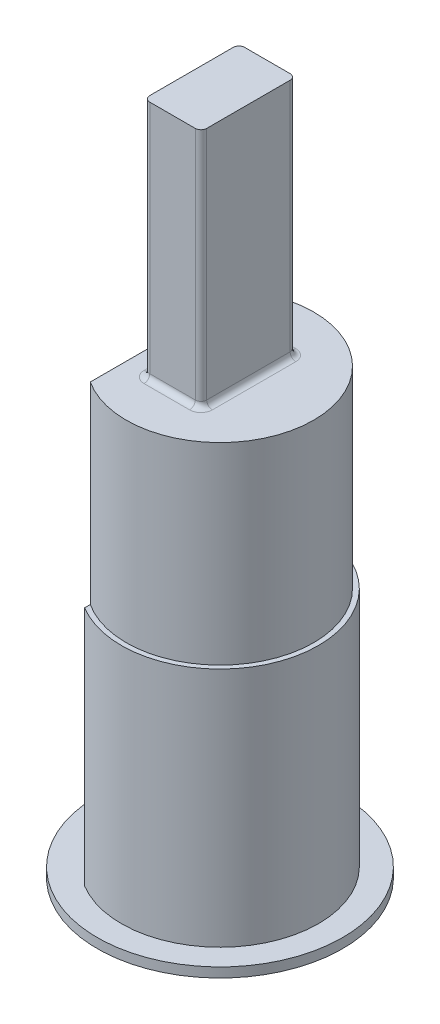
ISO-10303-21;
HEADER;
FILE_DESCRIPTION(('STEP AP214'),'2;1');
FILE_NAME('part.step','',(''),(''),'','','');
FILE_SCHEMA(('AUTOMOTIVE_DESIGN { 1 0 10303 214 1 1 1 1 }'));
ENDSEC;
DATA;
#1=APPLICATION_CONTEXT('core data for automotive mechanical design processes');
#2=APPLICATION_PROTOCOL_DEFINITION('international standard','automotive_design',2000,#1);
#3=PRODUCT_CONTEXT('',#1,'mechanical');
#4=PRODUCT('Part','Part','',(#3));
#5=PRODUCT_RELATED_PRODUCT_CATEGORY('part','',(#4));
#6=PRODUCT_DEFINITION_FORMATION('','',#4);
#7=PRODUCT_DEFINITION_CONTEXT('part definition',#1,'design');
#8=PRODUCT_DEFINITION('design','',#6,#7);
#9=PRODUCT_DEFINITION_SHAPE('','',#8);
#10=(LENGTH_UNIT() NAMED_UNIT(*) SI_UNIT(.MILLI.,.METRE.));
#11=(NAMED_UNIT(*) PLANE_ANGLE_UNIT() SI_UNIT($,.RADIAN.));
#12=(NAMED_UNIT(*) SI_UNIT($,.STERADIAN.) SOLID_ANGLE_UNIT());
#13=UNCERTAINTY_MEASURE_WITH_UNIT(LENGTH_MEASURE(1.E-05),#10,'distance_accuracy_value','');
#14=(GEOMETRIC_REPRESENTATION_CONTEXT(3) GLOBAL_UNCERTAINTY_ASSIGNED_CONTEXT((#13)) GLOBAL_UNIT_ASSIGNED_CONTEXT((#10,
#11,#12)) REPRESENTATION_CONTEXT('',''));
#15=CARTESIAN_POINT('',(0.,0.,0.));
#16=DIRECTION('',(0.,0.,1.));
#17=DIRECTION('',(1.,0.,0.));
#18=AXIS2_PLACEMENT_3D('',#15,#16,#17);
#19=CARTESIAN_POINT('',(0.,22.86,0.));
#20=DIRECTION('',(0.,1.,0.));
#21=DIRECTION('',(0.,0.,1.));
#22=AXIS2_PLACEMENT_3D('',#19,#20,#21);
#23=PLANE('',#22);
#24=DIRECTION('',(0.,0.,-1.));
#25=VECTOR('',#24,1.);
#26=CARTESIAN_POINT('',(1.8,22.86,0.));
#27=LINE('',#26,#25);
#28=CARTESIAN_POINT('',(1.8,22.86,-2.2));
#29=VERTEX_POINT('',#28);
#30=CARTESIAN_POINT('',(1.8,22.86,2.2));
#31=VERTEX_POINT('',#30);
#32=EDGE_CURVE('E222',#29,#31,#27,.F.);
#33=ORIENTED_EDGE('',*,*,#32,.T.);
#34=CARTESIAN_POINT('',(1.2,22.86,2.2));
#35=DIRECTION('',(0.,1.,0.));
#36=DIRECTION('',(0.,0.,1.));
#37=AXIS2_PLACEMENT_3D('',#34,#35,#36);
#38=CIRCLE('',#37,0.6);
#39=CARTESIAN_POINT('',(1.2,22.86,2.8));
#40=VERTEX_POINT('',#39);
#41=EDGE_CURVE('E207',#31,#40,#38,.F.);
#42=ORIENTED_EDGE('',*,*,#41,.T.);
#43=DIRECTION('',(1.,0.,0.));
#44=VECTOR('',#43,1.);
#45=CARTESIAN_POINT('',(0.,22.86,2.8));
#46=LINE('',#45,#44);
#47=CARTESIAN_POINT('',(-1.2,22.86,2.8));
#48=VERTEX_POINT('',#47);
#49=EDGE_CURVE('E210',#40,#48,#46,.F.);
#50=ORIENTED_EDGE('',*,*,#49,.T.);
#51=CARTESIAN_POINT('',(-1.2,22.86,2.2));
#52=DIRECTION('',(0.,1.,0.));
#53=DIRECTION('',(0.,0.,1.));
#54=AXIS2_PLACEMENT_3D('',#51,#52,#53);
#55=CIRCLE('',#54,0.6);
#56=CARTESIAN_POINT('',(-1.8,22.86,2.2));
#57=VERTEX_POINT('',#56);
#58=EDGE_CURVE('E212',#48,#57,#55,.F.);
#59=ORIENTED_EDGE('',*,*,#58,.T.);
#60=DIRECTION('',(0.,0.,1.));
#61=VECTOR('',#60,1.);
#62=CARTESIAN_POINT('',(-1.8,22.86,0.));
#63=LINE('',#62,#61);
#64=CARTESIAN_POINT('',(-1.8,22.86,-2.2));
#65=VERTEX_POINT('',#64);
#66=EDGE_CURVE('E214',#57,#65,#63,.F.);
#67=ORIENTED_EDGE('',*,*,#66,.T.);
#68=CARTESIAN_POINT('',(-1.2,22.86,-2.2));
#69=DIRECTION('',(0.,1.,0.));
#70=DIRECTION('',(0.,0.,1.));
#71=AXIS2_PLACEMENT_3D('',#68,#69,#70);
#72=CIRCLE('',#71,0.6);
#73=CARTESIAN_POINT('',(-1.2,22.86,-2.8));
#74=VERTEX_POINT('',#73);
#75=EDGE_CURVE('E216',#65,#74,#72,.F.);
#76=ORIENTED_EDGE('',*,*,#75,.T.);
#77=DIRECTION('',(-1.,0.,0.));
#78=VECTOR('',#77,1.);
#79=CARTESIAN_POINT('',(0.,22.86,-2.8));
#80=LINE('',#79,#78);
#81=CARTESIAN_POINT('',(1.2,22.86,-2.8));
#82=VERTEX_POINT('',#81);
#83=EDGE_CURVE('E218',#74,#82,#80,.F.);
#84=ORIENTED_EDGE('',*,*,#83,.T.);
#85=CARTESIAN_POINT('',(1.2,22.86,-2.2));
#86=DIRECTION('',(0.,1.,0.));
#87=DIRECTION('',(0.,0.,1.));
#88=AXIS2_PLACEMENT_3D('',#85,#86,#87);
#89=CIRCLE('',#88,0.6);
#90=EDGE_CURVE('E220',#82,#29,#89,.F.);
#91=ORIENTED_EDGE('',*,*,#90,.T.);
#92=EDGE_LOOP('',(#33,#42,#50,#59,#67,#76,#84,#91));
#93=FACE_BOUND('',#92,.T.);
#94=DIRECTION('',(0.,0.,1.));
#95=VECTOR('',#94,1.);
#96=CARTESIAN_POINT('',(-2.68996703044852,22.86,-4.445));
#97=LINE('',#96,#95);
#98=CARTESIAN_POINT('',(-2.68996703044852,22.86,-4.14526132348734));
#99=VERTEX_POINT('',#98);
#100=CARTESIAN_POINT('',(-2.68996703044852,22.86,4.14526132348734));
#101=VERTEX_POINT('',#100);
#102=EDGE_CURVE('E167',#99,#101,#97,.T.);
#103=ORIENTED_EDGE('',*,*,#102,.T.);
#104=CARTESIAN_POINT('',(0.,22.86,0.));
#105=DIRECTION('',(0.,1.,0.));
#106=DIRECTION('',(0.,0.,1.));
#107=AXIS2_PLACEMENT_3D('',#104,#105,#106);
#108=CIRCLE('',#107,4.94157);
#109=EDGE_CURVE('E53',#101,#99,#108,.T.);
#110=ORIENTED_EDGE('',*,*,#109,.T.);
#111=EDGE_LOOP('',(#103,#110));
#112=FACE_BOUND('',#111,.T.);
#113=ADVANCED_FACE('F37',(#93,#112),#23,.T.);
#114=CARTESIAN_POINT('',(0.,22.86,0.));
#115=DIRECTION('',(0.,-1.,0.));
#116=DIRECTION('',(0.,0.,-1.));
#117=AXIS2_PLACEMENT_3D('',#114,#115,#116);
#118=CYLINDRICAL_SURFACE('',#117,5.19557);
#119=CARTESIAN_POINT('',(0.,12.7,0.));
#120=DIRECTION('',(0.,1.,0.));
#121=DIRECTION('',(0.,0.,1.));
#122=AXIS2_PLACEMENT_3D('',#119,#120,#121);
#123=CIRCLE('',#122,5.19557);
#124=CARTESIAN_POINT('',(-2.68996703044852,12.7,4.445));
#125=VERTEX_POINT('',#124);
#126=CARTESIAN_POINT('',(-2.68996703044852,12.7,-4.445));
#127=VERTEX_POINT('',#126);
#128=EDGE_CURVE('E157',#125,#127,#123,.T.);
#129=ORIENTED_EDGE('',*,*,#128,.F.);
#130=DIRECTION('',(0.,-1.,0.));
#131=VECTOR('',#130,1.);
#132=CARTESIAN_POINT('',(-2.68996703044852,22.86,4.445));
#133=LINE('',#132,#131);
#134=CARTESIAN_POINT('',(-2.68996703044852,0.,4.445));
#135=VERTEX_POINT('',#134);
#136=EDGE_CURVE('E229',#125,#135,#133,.T.);
#137=ORIENTED_EDGE('',*,*,#136,.T.);
#138=CARTESIAN_POINT('',(0.,0.,0.));
#139=DIRECTION('',(0.,1.,0.));
#140=DIRECTION('',(0.,0.,1.));
#141=AXIS2_PLACEMENT_3D('',#138,#139,#140);
#142=CIRCLE('',#141,5.19557);
#143=CARTESIAN_POINT('',(-2.68996703044852,0.,-4.445));
#144=VERTEX_POINT('',#143);
#145=EDGE_CURVE('E234',#135,#144,#142,.T.);
#146=ORIENTED_EDGE('',*,*,#145,.T.);
#147=DIRECTION('',(0.,-1.,0.));
#148=VECTOR('',#147,1.);
#149=CARTESIAN_POINT('',(-2.68996703044852,22.86,-4.445));
#150=LINE('',#149,#148);
#151=EDGE_CURVE('E227',#127,#144,#150,.T.);
#152=ORIENTED_EDGE('',*,*,#151,.F.);
#153=EDGE_LOOP('',(#129,#137,#146,#152));
#154=FACE_BOUND('',#153,.T.);
#155=ADVANCED_FACE('F284',(#154),#118,.T.);
#156=CARTESIAN_POINT('',(-2.68996703044852,22.86,-4.445));
#157=DIRECTION('',(1.,0.,0.));
#158=DIRECTION('',(0.,0.,-1.));
#159=AXIS2_PLACEMENT_3D('',#156,#157,#158);
#160=PLANE('',#159);
#161=DIRECTION('',(0.,0.,1.));
#162=VECTOR('',#161,1.);
#163=CARTESIAN_POINT('',(-2.68996703044852,12.7,-4.445));
#164=LINE('',#163,#162);
#165=CARTESIAN_POINT('',(-2.68996703044852,12.7,-4.14526132348734));
#166=VERTEX_POINT('',#165);
#167=EDGE_CURVE('E12',#127,#166,#164,.T.);
#168=ORIENTED_EDGE('',*,*,#167,.F.);
#169=ORIENTED_EDGE('',*,*,#151,.T.);
#170=DIRECTION('',(0.,0.,1.));
#171=VECTOR('',#170,1.);
#172=CARTESIAN_POINT('',(-2.68996703044852,0.,-4.445));
#173=LINE('',#172,#171);
#174=EDGE_CURVE('E231',#144,#135,#173,.T.);
#175=ORIENTED_EDGE('',*,*,#174,.T.);
#176=ORIENTED_EDGE('',*,*,#136,.F.);
#177=CARTESIAN_POINT('',(-2.68996703044852,12.7,4.14526132348734));
#178=VERTEX_POINT('',#177);
#179=EDGE_CURVE('E46',#178,#125,#164,.T.);
#180=ORIENTED_EDGE('',*,*,#179,.F.);
#181=DIRECTION('',(0.,1.,0.));
#182=VECTOR('',#181,1.);
#183=CARTESIAN_POINT('',(-2.68996703044852,12.7,4.14526132348734));
#184=LINE('',#183,#182);
#185=EDGE_CURVE('E162',#101,#178,#184,.F.);
#186=ORIENTED_EDGE('',*,*,#185,.F.);
#187=ORIENTED_EDGE('',*,*,#102,.F.);
#188=DIRECTION('',(0.,1.,0.));
#189=VECTOR('',#188,1.);
#190=CARTESIAN_POINT('',(-2.68996703044852,12.7,-4.14526132348734));
#191=LINE('',#190,#189);
#192=EDGE_CURVE('E41',#166,#99,#191,.T.);
#193=ORIENTED_EDGE('',*,*,#192,.F.);
#194=EDGE_LOOP('',(#168,#169,#175,#176,#180,#186,#187,#193));
#195=FACE_BOUND('',#194,.T.);
#196=ADVANCED_FACE('F165',(#195),#160,.F.);
#197=CARTESIAN_POINT('',(-1.2,35.56,2.2));
#198=DIRECTION('',(0.,-1.,0.));
#199=DIRECTION('',(0.,0.,-1.));
#200=AXIS2_PLACEMENT_3D('',#197,#198,#199);
#201=CYLINDRICAL_SURFACE('',#200,0.3);
#202=DIRECTION('',(0.,-1.,0.));
#203=VECTOR('',#202,1.);
#204=CARTESIAN_POINT('',(-1.5,35.56,2.2));
#205=LINE('',#204,#203);
#206=CARTESIAN_POINT('',(-1.5,35.56,2.2));
#207=VERTEX_POINT('',#206);
#208=CARTESIAN_POINT('',(-1.5,23.16,2.2));
#209=VERTEX_POINT('',#208);
#210=EDGE_CURVE('E257',#207,#209,#205,.T.);
#211=ORIENTED_EDGE('',*,*,#210,.T.);
#212=CARTESIAN_POINT('',(-1.2,23.16,2.2));
#213=DIRECTION('',(0.,1.,0.));
#214=DIRECTION('',(0.,0.,1.));
#215=AXIS2_PLACEMENT_3D('',#212,#213,#214);
#216=CIRCLE('',#215,0.3);
#217=CARTESIAN_POINT('',(-1.2,23.16,2.5));
#218=VERTEX_POINT('',#217);
#219=EDGE_CURVE('E203',#209,#218,#216,.T.);
#220=ORIENTED_EDGE('',*,*,#219,.T.);
#221=DIRECTION('',(0.,-1.,0.));
#222=VECTOR('',#221,1.);
#223=CARTESIAN_POINT('',(-1.2,35.56,2.5));
#224=LINE('',#223,#222);
#225=CARTESIAN_POINT('',(-1.2,35.56,2.5));
#226=VERTEX_POINT('',#225);
#227=EDGE_CURVE('E237',#226,#218,#224,.T.);
#228=ORIENTED_EDGE('',*,*,#227,.F.);
#229=CARTESIAN_POINT('',(-1.2,35.56,2.2));
#230=DIRECTION('',(0.,1.,0.));
#231=DIRECTION('',(0.,0.,-1.));
#232=AXIS2_PLACEMENT_3D('',#229,#230,#231);
#233=CIRCLE('',#232,0.3);
#234=EDGE_CURVE('E173',#207,#226,#233,.T.);
#235=ORIENTED_EDGE('',*,*,#234,.F.);
#236=EDGE_LOOP('',(#211,#220,#228,#235));
#237=FACE_BOUND('',#236,.T.);
#238=ADVANCED_FACE('F294',(#237),#201,.T.);
#239=CARTESIAN_POINT('',(-1.2,35.56,2.5));
#240=DIRECTION('',(0.,0.,-1.));
#241=DIRECTION('',(-1.,0.,0.));
#242=AXIS2_PLACEMENT_3D('',#239,#240,#241);
#243=PLANE('',#242);
#244=ORIENTED_EDGE('',*,*,#227,.T.);
#245=DIRECTION('',(1.,0.,0.));
#246=VECTOR('',#245,1.);
#247=CARTESIAN_POINT('',(-1.2,23.16,2.5));
#248=LINE('',#247,#246);
#249=CARTESIAN_POINT('',(1.2,23.16,2.5));
#250=VERTEX_POINT('',#249);
#251=EDGE_CURVE('E205',#218,#250,#248,.T.);
#252=ORIENTED_EDGE('',*,*,#251,.T.);
#253=DIRECTION('',(0.,-1.,0.));
#254=VECTOR('',#253,1.);
#255=CARTESIAN_POINT('',(1.2,35.56,2.5));
#256=LINE('',#255,#254);
#257=CARTESIAN_POINT('',(1.2,35.56,2.5));
#258=VERTEX_POINT('',#257);
#259=EDGE_CURVE('E241',#258,#250,#256,.T.);
#260=ORIENTED_EDGE('',*,*,#259,.F.);
#261=DIRECTION('',(1.,0.,0.));
#262=VECTOR('',#261,1.);
#263=CARTESIAN_POINT('',(-1.2,35.56,2.5));
#264=LINE('',#263,#262);
#265=EDGE_CURVE('E272',#226,#258,#264,.T.);
#266=ORIENTED_EDGE('',*,*,#265,.F.);
#267=EDGE_LOOP('',(#244,#252,#260,#266));
#268=FACE_BOUND('',#267,.T.);
#269=ADVANCED_FACE('F348',(#268),#243,.F.);
#270=CARTESIAN_POINT('',(1.2,35.56,2.2));
#271=DIRECTION('',(0.,-1.,0.));
#272=DIRECTION('',(0.,0.,-1.));
#273=AXIS2_PLACEMENT_3D('',#270,#271,#272);
#274=CYLINDRICAL_SURFACE('',#273,0.3);
#275=ORIENTED_EDGE('',*,*,#259,.T.);
#276=CARTESIAN_POINT('',(1.2,23.16,2.2));
#277=DIRECTION('',(0.,1.,0.));
#278=DIRECTION('',(0.,0.,1.));
#279=AXIS2_PLACEMENT_3D('',#276,#277,#278);
#280=CIRCLE('',#279,0.3);
#281=CARTESIAN_POINT('',(1.5,23.16,2.2));
#282=VERTEX_POINT('',#281);
#283=EDGE_CURVE('E224',#250,#282,#280,.T.);
#284=ORIENTED_EDGE('',*,*,#283,.T.);
#285=DIRECTION('',(0.,-1.,0.));
#286=VECTOR('',#285,1.);
#287=CARTESIAN_POINT('',(1.5,35.56,2.2));
#288=LINE('',#287,#286);
#289=CARTESIAN_POINT('',(1.5,35.56,2.2));
#290=VERTEX_POINT('',#289);
#291=EDGE_CURVE('E244',#290,#282,#288,.T.);
#292=ORIENTED_EDGE('',*,*,#291,.F.);
#293=CARTESIAN_POINT('',(1.2,35.56,2.2));
#294=DIRECTION('',(0.,1.,0.));
#295=DIRECTION('',(0.,0.,1.));
#296=AXIS2_PLACEMENT_3D('',#293,#294,#295);
#297=CIRCLE('',#296,0.3);
#298=EDGE_CURVE('E270',#258,#290,#297,.T.);
#299=ORIENTED_EDGE('',*,*,#298,.F.);
#300=EDGE_LOOP('',(#275,#284,#292,#299));
#301=FACE_BOUND('',#300,.T.);
#302=ADVANCED_FACE('F352',(#301),#274,.T.);
#303=CARTESIAN_POINT('',(1.5,35.56,2.2));
#304=DIRECTION('',(-1.,0.,0.));
#305=DIRECTION('',(0.,0.,1.));
#306=AXIS2_PLACEMENT_3D('',#303,#304,#305);
#307=PLANE('',#306);
#308=ORIENTED_EDGE('',*,*,#291,.T.);
#309=DIRECTION('',(0.,0.,-1.));
#310=VECTOR('',#309,1.);
#311=CARTESIAN_POINT('',(1.5,23.16,2.2));
#312=LINE('',#311,#310);
#313=CARTESIAN_POINT('',(1.5,23.16,-2.2));
#314=VERTEX_POINT('',#313);
#315=EDGE_CURVE('E61',#282,#314,#312,.T.);
#316=ORIENTED_EDGE('',*,*,#315,.T.);
#317=DIRECTION('',(0.,-1.,0.));
#318=VECTOR('',#317,1.);
#319=CARTESIAN_POINT('',(1.5,35.56,-2.2));
#320=LINE('',#319,#318);
#321=CARTESIAN_POINT('',(1.5,35.56,-2.2));
#322=VERTEX_POINT('',#321);
#323=EDGE_CURVE('E246',#322,#314,#320,.T.);
#324=ORIENTED_EDGE('',*,*,#323,.F.);
#325=DIRECTION('',(0.,0.,-1.));
#326=VECTOR('',#325,1.);
#327=CARTESIAN_POINT('',(1.5,35.56,2.2));
#328=LINE('',#327,#326);
#329=EDGE_CURVE('E268',#290,#322,#328,.T.);
#330=ORIENTED_EDGE('',*,*,#329,.F.);
#331=EDGE_LOOP('',(#308,#316,#324,#330));
#332=FACE_BOUND('',#331,.T.);
#333=ADVANCED_FACE('F381',(#332),#307,.F.);
#334=CARTESIAN_POINT('',(1.2,35.56,-2.2));
#335=DIRECTION('',(0.,-1.,0.));
#336=DIRECTION('',(0.,0.,-1.));
#337=AXIS2_PLACEMENT_3D('',#334,#335,#336);
#338=CYLINDRICAL_SURFACE('',#337,0.3);
#339=ORIENTED_EDGE('',*,*,#323,.T.);
#340=CARTESIAN_POINT('',(1.2,23.16,-2.2));
#341=DIRECTION('',(0.,1.,0.));
#342=DIRECTION('',(0.,0.,1.));
#343=AXIS2_PLACEMENT_3D('',#340,#341,#342);
#344=CIRCLE('',#343,0.3);
#345=CARTESIAN_POINT('',(1.2,23.16,-2.5));
#346=VERTEX_POINT('',#345);
#347=EDGE_CURVE('E195',#314,#346,#344,.T.);
#348=ORIENTED_EDGE('',*,*,#347,.T.);
#349=DIRECTION('',(0.,-1.,0.));
#350=VECTOR('',#349,1.);
#351=CARTESIAN_POINT('',(1.2,35.56,-2.5));
#352=LINE('',#351,#350);
#353=CARTESIAN_POINT('',(1.2,35.56,-2.5));
#354=VERTEX_POINT('',#353);
#355=EDGE_CURVE('E248',#354,#346,#352,.T.);
#356=ORIENTED_EDGE('',*,*,#355,.F.);
#357=CARTESIAN_POINT('',(1.2,35.56,-2.2));
#358=DIRECTION('',(0.,1.,0.));
#359=DIRECTION('',(0.,0.,-1.));
#360=AXIS2_PLACEMENT_3D('',#357,#358,#359);
#361=CIRCLE('',#360,0.3);
#362=EDGE_CURVE('E266',#322,#354,#361,.T.);
#363=ORIENTED_EDGE('',*,*,#362,.F.);
#364=EDGE_LOOP('',(#339,#348,#356,#363));
#365=FACE_BOUND('',#364,.T.);
#366=ADVANCED_FACE('F379',(#365),#338,.T.);
#367=CARTESIAN_POINT('',(-1.2,35.56,-2.5));
#368=DIRECTION('',(0.,0.,1.));
#369=DIRECTION('',(1.,0.,0.));
#370=AXIS2_PLACEMENT_3D('',#367,#368,#369);
#371=PLANE('',#370);
#372=ORIENTED_EDGE('',*,*,#355,.T.);
#373=DIRECTION('',(-1.,0.,0.));
#374=VECTOR('',#373,1.);
#375=CARTESIAN_POINT('',(-1.2,23.16,-2.5));
#376=LINE('',#375,#374);
#377=CARTESIAN_POINT('',(-1.2,23.16,-2.5));
#378=VERTEX_POINT('',#377);
#379=EDGE_CURVE('E197',#346,#378,#376,.T.);
#380=ORIENTED_EDGE('',*,*,#379,.T.);
#381=DIRECTION('',(0.,-1.,0.));
#382=VECTOR('',#381,1.);
#383=CARTESIAN_POINT('',(-1.2,35.56,-2.5));
#384=LINE('',#383,#382);
#385=CARTESIAN_POINT('',(-1.2,35.56,-2.5));
#386=VERTEX_POINT('',#385);
#387=EDGE_CURVE('E251',#386,#378,#384,.T.);
#388=ORIENTED_EDGE('',*,*,#387,.F.);
#389=DIRECTION('',(-1.,0.,0.));
#390=VECTOR('',#389,1.);
#391=CARTESIAN_POINT('',(-1.2,35.56,-2.5));
#392=LINE('',#391,#390);
#393=EDGE_CURVE('E264',#354,#386,#392,.T.);
#394=ORIENTED_EDGE('',*,*,#393,.F.);
#395=EDGE_LOOP('',(#372,#380,#388,#394));
#396=FACE_BOUND('',#395,.T.);
#397=ADVANCED_FACE('F369',(#396),#371,.F.);
#398=CARTESIAN_POINT('',(-1.2,35.56,-2.2));
#399=DIRECTION('',(0.,-1.,0.));
#400=DIRECTION('',(0.,0.,-1.));
#401=AXIS2_PLACEMENT_3D('',#398,#399,#400);
#402=CYLINDRICAL_SURFACE('',#401,0.3);
#403=ORIENTED_EDGE('',*,*,#387,.T.);
#404=CARTESIAN_POINT('',(-1.2,23.16,-2.2));
#405=DIRECTION('',(0.,1.,0.));
#406=DIRECTION('',(0.,0.,1.));
#407=AXIS2_PLACEMENT_3D('',#404,#405,#406);
#408=CIRCLE('',#407,0.3);
#409=CARTESIAN_POINT('',(-1.5,23.16,-2.2));
#410=VERTEX_POINT('',#409);
#411=EDGE_CURVE('E199',#378,#410,#408,.T.);
#412=ORIENTED_EDGE('',*,*,#411,.T.);
#413=DIRECTION('',(0.,-1.,0.));
#414=VECTOR('',#413,1.);
#415=CARTESIAN_POINT('',(-1.5,35.56,-2.2));
#416=LINE('',#415,#414);
#417=CARTESIAN_POINT('',(-1.5,35.56,-2.2));
#418=VERTEX_POINT('',#417);
#419=EDGE_CURVE('E254',#418,#410,#416,.T.);
#420=ORIENTED_EDGE('',*,*,#419,.F.);
#421=CARTESIAN_POINT('',(-1.2,35.56,-2.2));
#422=DIRECTION('',(0.,1.,0.));
#423=DIRECTION('',(0.,0.,-1.));
#424=AXIS2_PLACEMENT_3D('',#421,#422,#423);
#425=CIRCLE('',#424,0.3);
#426=EDGE_CURVE('E262',#386,#418,#425,.T.);
#427=ORIENTED_EDGE('',*,*,#426,.F.);
#428=EDGE_LOOP('',(#403,#412,#420,#427));
#429=FACE_BOUND('',#428,.T.);
#430=ADVANCED_FACE('F365',(#429),#402,.T.);
#431=CARTESIAN_POINT('',(-1.5,35.56,2.2));
#432=DIRECTION('',(1.,0.,0.));
#433=DIRECTION('',(0.,0.,-1.));
#434=AXIS2_PLACEMENT_3D('',#431,#432,#433);
#435=PLANE('',#434);
#436=ORIENTED_EDGE('',*,*,#419,.T.);
#437=DIRECTION('',(0.,0.,1.));
#438=VECTOR('',#437,1.);
#439=CARTESIAN_POINT('',(-1.5,23.16,2.2));
#440=LINE('',#439,#438);
#441=EDGE_CURVE('E201',#410,#209,#440,.T.);
#442=ORIENTED_EDGE('',*,*,#441,.T.);
#443=ORIENTED_EDGE('',*,*,#210,.F.);
#444=DIRECTION('',(0.,0.,1.));
#445=VECTOR('',#444,1.);
#446=CARTESIAN_POINT('',(-1.5,35.56,2.2));
#447=LINE('',#446,#445);
#448=EDGE_CURVE('E260',#418,#207,#447,.T.);
#449=ORIENTED_EDGE('',*,*,#448,.F.);
#450=EDGE_LOOP('',(#436,#442,#443,#449));
#451=FACE_BOUND('',#450,.T.);
#452=ADVANCED_FACE('F361',(#451),#435,.F.);
#453=CARTESIAN_POINT('',(-1.2,35.56,2.2));
#454=DIRECTION('',(0.,-1.,0.));
#455=DIRECTION('',(0.,0.,-1.));
#456=AXIS2_PLACEMENT_3D('',#453,#454,#455);
#457=PLANE('',#456);
#458=ORIENTED_EDGE('',*,*,#234,.T.);
#459=ORIENTED_EDGE('',*,*,#265,.T.);
#460=ORIENTED_EDGE('',*,*,#298,.T.);
#461=ORIENTED_EDGE('',*,*,#329,.T.);
#462=ORIENTED_EDGE('',*,*,#362,.T.);
#463=ORIENTED_EDGE('',*,*,#393,.T.);
#464=ORIENTED_EDGE('',*,*,#426,.T.);
#465=ORIENTED_EDGE('',*,*,#448,.T.);
#466=EDGE_LOOP('',(#458,#459,#460,#461,#462,#463,#464,#465));
#467=FACE_BOUND('',#466,.T.);
#468=ADVANCED_FACE('F328',(#467),#457,.F.);
#469=CARTESIAN_POINT('',(-1.2,23.16,-2.2));
#470=DIRECTION('',(0.,1.,0.));
#471=DIRECTION('',(0.,0.,1.));
#472=AXIS2_PLACEMENT_3D('',#469,#470,#471);
#473=TOROIDAL_SURFACE('',#472,0.6,0.3);
#474=CARTESIAN_POINT('',(-1.2,23.16,-2.8));
#475=DIRECTION('',(-1.,0.,0.));
#476=DIRECTION('',(0.,0.,1.));
#477=AXIS2_PLACEMENT_3D('',#474,#475,#476);
#478=CIRCLE('',#477,0.3);
#479=EDGE_CURVE('E174',#74,#378,#478,.T.);
#480=ORIENTED_EDGE('',*,*,#479,.F.);
#481=ORIENTED_EDGE('',*,*,#75,.F.);
#482=CARTESIAN_POINT('',(-1.8,23.16,-2.2));
#483=DIRECTION('',(0.,0.,-1.));
#484=DIRECTION('',(-1.,0.,0.));
#485=AXIS2_PLACEMENT_3D('',#482,#483,#484);
#486=CIRCLE('',#485,0.3);
#487=EDGE_CURVE('E170',#410,#65,#486,.T.);
#488=ORIENTED_EDGE('',*,*,#487,.F.);
#489=ORIENTED_EDGE('',*,*,#411,.F.);
#490=EDGE_LOOP('',(#480,#481,#488,#489));
#491=FACE_BOUND('',#490,.T.);
#492=ADVANCED_FACE('F39',(#491),#473,.F.);
#493=CARTESIAN_POINT('',(-1.8,23.16,2.2));
#494=DIRECTION('',(0.,0.,1.));
#495=DIRECTION('',(1.,0.,0.));
#496=AXIS2_PLACEMENT_3D('',#493,#494,#495);
#497=CYLINDRICAL_SURFACE('',#496,0.3);
#498=ORIENTED_EDGE('',*,*,#487,.T.);
#499=ORIENTED_EDGE('',*,*,#66,.F.);
#500=CARTESIAN_POINT('',(-1.8,23.16,2.2));
#501=DIRECTION('',(0.,0.,-1.));
#502=DIRECTION('',(0.,1.,0.));
#503=AXIS2_PLACEMENT_3D('',#500,#501,#502);
#504=CIRCLE('',#503,0.3);
#505=EDGE_CURVE('E177',#209,#57,#504,.T.);
#506=ORIENTED_EDGE('',*,*,#505,.F.);
#507=ORIENTED_EDGE('',*,*,#441,.F.);
#508=EDGE_LOOP('',(#498,#499,#506,#507));
#509=FACE_BOUND('',#508,.T.);
#510=ADVANCED_FACE('F321',(#509),#497,.F.);
#511=CARTESIAN_POINT('',(-1.2,23.16,-2.8));
#512=DIRECTION('',(-1.,0.,0.));
#513=DIRECTION('',(0.,0.,1.));
#514=AXIS2_PLACEMENT_3D('',#511,#512,#513);
#515=CYLINDRICAL_SURFACE('',#514,0.3);
#516=ORIENTED_EDGE('',*,*,#479,.T.);
#517=ORIENTED_EDGE('',*,*,#379,.F.);
#518=CARTESIAN_POINT('',(1.2,23.16,-2.8));
#519=DIRECTION('',(-1.,0.,0.));
#520=DIRECTION('',(0.,0.,1.));
#521=AXIS2_PLACEMENT_3D('',#518,#519,#520);
#522=CIRCLE('',#521,0.3);
#523=EDGE_CURVE('E180',#82,#346,#522,.T.);
#524=ORIENTED_EDGE('',*,*,#523,.F.);
#525=ORIENTED_EDGE('',*,*,#83,.F.);
#526=EDGE_LOOP('',(#516,#517,#524,#525));
#527=FACE_BOUND('',#526,.T.);
#528=ADVANCED_FACE('F318',(#527),#515,.F.);
#529=CARTESIAN_POINT('',(-1.2,23.16,2.2));
#530=DIRECTION('',(0.,1.,0.));
#531=DIRECTION('',(0.,0.,1.));
#532=AXIS2_PLACEMENT_3D('',#529,#530,#531);
#533=TOROIDAL_SURFACE('',#532,0.6,0.3);
#534=ORIENTED_EDGE('',*,*,#505,.T.);
#535=ORIENTED_EDGE('',*,*,#58,.F.);
#536=CARTESIAN_POINT('',(-1.2,23.16,2.8));
#537=DIRECTION('',(-1.,0.,0.));
#538=DIRECTION('',(0.,0.,1.));
#539=AXIS2_PLACEMENT_3D('',#536,#537,#538);
#540=CIRCLE('',#539,0.3);
#541=EDGE_CURVE('E183',#218,#48,#540,.T.);
#542=ORIENTED_EDGE('',*,*,#541,.F.);
#543=ORIENTED_EDGE('',*,*,#219,.F.);
#544=EDGE_LOOP('',(#534,#535,#542,#543));
#545=FACE_BOUND('',#544,.T.);
#546=ADVANCED_FACE('F314',(#545),#533,.F.);
#547=CARTESIAN_POINT('',(1.2,23.16,-2.2));
#548=DIRECTION('',(0.,1.,0.));
#549=DIRECTION('',(0.,0.,1.));
#550=AXIS2_PLACEMENT_3D('',#547,#548,#549);
#551=TOROIDAL_SURFACE('',#550,0.6,0.3);
#552=ORIENTED_EDGE('',*,*,#523,.T.);
#553=ORIENTED_EDGE('',*,*,#347,.F.);
#554=CARTESIAN_POINT('',(1.8,23.16,-2.2));
#555=DIRECTION('',(0.,0.,-1.));
#556=DIRECTION('',(-1.,0.,0.));
#557=AXIS2_PLACEMENT_3D('',#554,#555,#556);
#558=CIRCLE('',#557,0.3);
#559=EDGE_CURVE('E186',#29,#314,#558,.T.);
#560=ORIENTED_EDGE('',*,*,#559,.F.);
#561=ORIENTED_EDGE('',*,*,#90,.F.);
#562=EDGE_LOOP('',(#552,#553,#560,#561));
#563=FACE_BOUND('',#562,.T.);
#564=ADVANCED_FACE('F310',(#563),#551,.F.);
#565=CARTESIAN_POINT('',(-1.2,23.16,2.8));
#566=DIRECTION('',(1.,0.,0.));
#567=DIRECTION('',(0.,0.,-1.));
#568=AXIS2_PLACEMENT_3D('',#565,#566,#567);
#569=CYLINDRICAL_SURFACE('',#568,0.3);
#570=ORIENTED_EDGE('',*,*,#541,.T.);
#571=ORIENTED_EDGE('',*,*,#49,.F.);
#572=CARTESIAN_POINT('',(1.2,23.16,2.8));
#573=DIRECTION('',(-1.,0.,0.));
#574=DIRECTION('',(0.,-1.,0.));
#575=AXIS2_PLACEMENT_3D('',#572,#573,#574);
#576=CIRCLE('',#575,0.3);
#577=EDGE_CURVE('E189',#250,#40,#576,.T.);
#578=ORIENTED_EDGE('',*,*,#577,.F.);
#579=ORIENTED_EDGE('',*,*,#251,.F.);
#580=EDGE_LOOP('',(#570,#571,#578,#579));
#581=FACE_BOUND('',#580,.T.);
#582=ADVANCED_FACE('F306',(#581),#569,.F.);
#583=CARTESIAN_POINT('',(1.8,23.16,2.2));
#584=DIRECTION('',(0.,0.,-1.));
#585=DIRECTION('',(-1.,0.,0.));
#586=AXIS2_PLACEMENT_3D('',#583,#584,#585);
#587=CYLINDRICAL_SURFACE('',#586,0.3);
#588=ORIENTED_EDGE('',*,*,#559,.T.);
#589=ORIENTED_EDGE('',*,*,#315,.F.);
#590=CARTESIAN_POINT('',(1.8,23.16,2.2));
#591=DIRECTION('',(0.,0.,-1.));
#592=DIRECTION('',(-1.,0.,0.));
#593=AXIS2_PLACEMENT_3D('',#590,#591,#592);
#594=CIRCLE('',#593,0.3);
#595=EDGE_CURVE('E191',#31,#282,#594,.T.);
#596=ORIENTED_EDGE('',*,*,#595,.F.);
#597=ORIENTED_EDGE('',*,*,#32,.F.);
#598=EDGE_LOOP('',(#588,#589,#596,#597));
#599=FACE_BOUND('',#598,.T.);
#600=ADVANCED_FACE('F302',(#599),#587,.F.);
#601=CARTESIAN_POINT('',(1.2,23.16,2.2));
#602=DIRECTION('',(0.,1.,0.));
#603=DIRECTION('',(0.,0.,1.));
#604=AXIS2_PLACEMENT_3D('',#601,#602,#603);
#605=TOROIDAL_SURFACE('',#604,0.6,0.3);
#606=ORIENTED_EDGE('',*,*,#577,.T.);
#607=ORIENTED_EDGE('',*,*,#41,.F.);
#608=ORIENTED_EDGE('',*,*,#595,.T.);
#609=ORIENTED_EDGE('',*,*,#283,.F.);
#610=EDGE_LOOP('',(#606,#607,#608,#609));
#611=FACE_BOUND('',#610,.T.);
#612=ADVANCED_FACE('F298',(#611),#605,.F.);
#613=CARTESIAN_POINT('',(0.,-0.508,0.));
#614=DIRECTION('',(0.,1.,0.));
#615=DIRECTION('',(0.,0.,1.));
#616=AXIS2_PLACEMENT_3D('',#613,#614,#615);
#617=CYLINDRICAL_SURFACE('',#616,6.46557);
#618=CARTESIAN_POINT('',(0.,-0.508,0.));
#619=DIRECTION('',(0.,-1.,0.));
#620=DIRECTION('',(0.,0.,-1.));
#621=AXIS2_PLACEMENT_3D('',#618,#619,#620);
#622=CIRCLE('',#621,6.46557);
#623=CARTESIAN_POINT('',(0.,-0.508,-6.46557));
#624=VERTEX_POINT('',#623);
#625=EDGE_CURVE('E193',#624,#624,#622,.T.);
#626=ORIENTED_EDGE('',*,*,#625,.F.);
#627=EDGE_LOOP('',(#626));
#628=FACE_BOUND('',#627,.T.);
#629=CARTESIAN_POINT('',(0.,0.,0.));
#630=DIRECTION('',(0.,-1.,0.));
#631=DIRECTION('',(0.,0.,-1.));
#632=AXIS2_PLACEMENT_3D('',#629,#630,#631);
#633=CIRCLE('',#632,6.46557);
#634=CARTESIAN_POINT('',(0.,0.,-6.46557));
#635=VERTEX_POINT('',#634);
#636=EDGE_CURVE('E276',#635,#635,#633,.T.);
#637=ORIENTED_EDGE('',*,*,#636,.T.);
#638=EDGE_LOOP('',(#637));
#639=FACE_BOUND('',#638,.T.);
#640=ADVANCED_FACE('F301',(#628,#639),#617,.T.);
#641=CARTESIAN_POINT('',(0.,-0.508,0.));
#642=DIRECTION('',(0.,-1.,0.));
#643=DIRECTION('',(0.,0.,-1.));
#644=AXIS2_PLACEMENT_3D('',#641,#642,#643);
#645=PLANE('',#644);
#646=ORIENTED_EDGE('',*,*,#625,.T.);
#647=EDGE_LOOP('',(#646));
#648=FACE_BOUND('',#647,.T.);
#649=ADVANCED_FACE('F424',(#648),#645,.T.);
#650=CARTESIAN_POINT('',(0.,0.,0.));
#651=DIRECTION('',(0.,-1.,0.));
#652=DIRECTION('',(0.,0.,-1.));
#653=AXIS2_PLACEMENT_3D('',#650,#651,#652);
#654=PLANE('',#653);
#655=ORIENTED_EDGE('',*,*,#145,.F.);
#656=ORIENTED_EDGE('',*,*,#174,.F.);
#657=EDGE_LOOP('',(#655,#656));
#658=FACE_BOUND('',#657,.T.);
#659=ORIENTED_EDGE('',*,*,#636,.F.);
#660=EDGE_LOOP('',(#659));
#661=FACE_BOUND('',#660,.T.);
#662=ADVANCED_FACE('F419',(#658,#661),#654,.F.);
#663=CARTESIAN_POINT('',(0.,12.7,0.));
#664=DIRECTION('',(0.,1.,0.));
#665=DIRECTION('',(0.,0.,1.));
#666=AXIS2_PLACEMENT_3D('',#663,#664,#665);
#667=PLANE('',#666);
#668=ORIENTED_EDGE('',*,*,#167,.T.);
#669=CARTESIAN_POINT('',(0.,12.7,0.));
#670=DIRECTION('',(0.,1.,0.));
#671=DIRECTION('',(0.,0.,1.));
#672=AXIS2_PLACEMENT_3D('',#669,#670,#671);
#673=CIRCLE('',#672,4.94157);
#674=EDGE_CURVE('E154',#178,#166,#673,.T.);
#675=ORIENTED_EDGE('',*,*,#674,.F.);
#676=ORIENTED_EDGE('',*,*,#179,.T.);
#677=ORIENTED_EDGE('',*,*,#128,.T.);
#678=EDGE_LOOP('',(#668,#675,#676,#677));
#679=FACE_BOUND('',#678,.T.);
#680=ADVANCED_FACE('F153',(#679),#667,.T.);
#681=CARTESIAN_POINT('',(0.,12.7,0.));
#682=DIRECTION('',(0.,1.,0.));
#683=DIRECTION('',(0.,0.,1.));
#684=AXIS2_PLACEMENT_3D('',#681,#682,#683);
#685=CYLINDRICAL_SURFACE('',#684,4.94157);
#686=ORIENTED_EDGE('',*,*,#192,.T.);
#687=ORIENTED_EDGE('',*,*,#109,.F.);
#688=ORIENTED_EDGE('',*,*,#185,.T.);
#689=ORIENTED_EDGE('',*,*,#674,.T.);
#690=EDGE_LOOP('',(#686,#687,#688,#689));
#691=FACE_BOUND('',#690,.T.);
#692=ADVANCED_FACE('F161',(#691),#685,.T.);
#693=CLOSED_SHELL('',(#113,#155,#196,#238,#269,#302,#333,#366,#397,#430,#452,#468,#492,#510,
#528,#546,#564,#582,#600,#612,#640,#649,#662,#680,#692));
#694=MANIFOLD_SOLID_BREP('B2',#693);
#695=ADVANCED_BREP_SHAPE_REPRESENTATION('',(#18,#694),#14);
#696=SHAPE_DEFINITION_REPRESENTATION(#9,#695);
ENDSEC;
END-ISO-10303-21;
